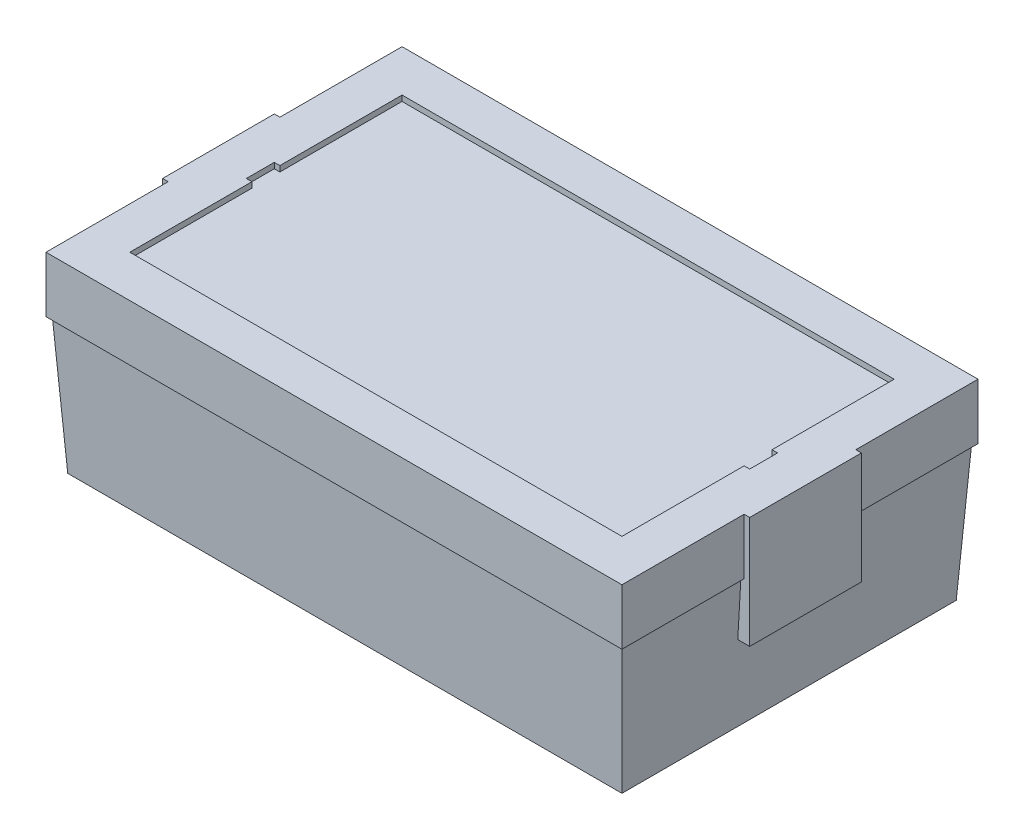
ISO-10303-21;
HEADER;
FILE_DESCRIPTION(('STEP AP214'),'2;1');
FILE_NAME('part.step','',(''),(''),'','','');
FILE_SCHEMA(('AUTOMOTIVE_DESIGN { 1 0 10303 214 1 1 1 1 }'));
ENDSEC;
DATA;
#1=APPLICATION_CONTEXT('core data for automotive mechanical design processes');
#2=APPLICATION_PROTOCOL_DEFINITION('international standard','automotive_design',2000,#1);
#3=PRODUCT_CONTEXT('',#1,'mechanical');
#4=PRODUCT('Part','Part','',(#3));
#5=PRODUCT_RELATED_PRODUCT_CATEGORY('part','',(#4));
#6=PRODUCT_DEFINITION_FORMATION('','',#4);
#7=PRODUCT_DEFINITION_CONTEXT('part definition',#1,'design');
#8=PRODUCT_DEFINITION('design','',#6,#7);
#9=PRODUCT_DEFINITION_SHAPE('','',#8);
#10=(LENGTH_UNIT() NAMED_UNIT(*) SI_UNIT(.MILLI.,.METRE.));
#11=(NAMED_UNIT(*) PLANE_ANGLE_UNIT() SI_UNIT($,.RADIAN.));
#12=(NAMED_UNIT(*) SI_UNIT($,.STERADIAN.) SOLID_ANGLE_UNIT());
#13=UNCERTAINTY_MEASURE_WITH_UNIT(LENGTH_MEASURE(1.E-05),#10,'distance_accuracy_value','');
#14=(GEOMETRIC_REPRESENTATION_CONTEXT(3) GLOBAL_UNCERTAINTY_ASSIGNED_CONTEXT((#13)) GLOBAL_UNIT_ASSIGNED_CONTEXT((#10,
#11,#12)) REPRESENTATION_CONTEXT('',''));
#15=CARTESIAN_POINT('',(0.,0.,0.));
#16=DIRECTION('',(0.,0.,1.));
#17=DIRECTION('',(1.,0.,0.));
#18=AXIS2_PLACEMENT_3D('',#15,#16,#17);
#19=CARTESIAN_POINT('',(0.,14.29,0.));
#20=DIRECTION('',(0.,1.,0.));
#21=DIRECTION('',(0.,0.,1.));
#22=AXIS2_PLACEMENT_3D('',#19,#20,#21);
#23=PLANE('',#22);
#24=DIRECTION('',(0.,0.,1.));
#25=VECTOR('',#24,1.);
#26=CARTESIAN_POINT('',(-101.978572312899,14.29,59.85));
#27=LINE('',#26,#25);
#28=CARTESIAN_POINT('',(-101.978572312899,14.29,-20.));
#29=VERTEX_POINT('',#28);
#30=CARTESIAN_POINT('',(-101.978572312899,14.29,-62.6085723128994));
#31=VERTEX_POINT('',#30);
#32=EDGE_CURVE('E454',#29,#31,#27,.F.);
#33=ORIENTED_EDGE('',*,*,#32,.F.);
#34=DIRECTION('',(-1.,0.,0.));
#35=VECTOR('',#34,1.);
#36=CARTESIAN_POINT('',(0.,14.29,-20.));
#37=LINE('',#36,#35);
#38=CARTESIAN_POINT('',(-103.114254615452,14.29,-20.));
#39=VERTEX_POINT('',#38);
#40=EDGE_CURVE('E385',#29,#39,#37,.T.);
#41=ORIENTED_EDGE('',*,*,#40,.T.);
#42=DIRECTION('',(0.,0.,1.));
#43=VECTOR('',#42,1.);
#44=CARTESIAN_POINT('',(-103.114254615452,14.29,-63.7442546154517));
#45=LINE('',#44,#43);
#46=CARTESIAN_POINT('',(-103.114254615452,14.29,-63.7442546154517));
#47=VERTEX_POINT('',#46);
#48=EDGE_CURVE('E433',#47,#39,#45,.T.);
#49=ORIENTED_EDGE('',*,*,#48,.F.);
#50=DIRECTION('',(-1.,0.,0.));
#51=VECTOR('',#50,1.);
#52=CARTESIAN_POINT('',(103.114254615452,14.29,-63.7442546154517));
#53=LINE('',#52,#51);
#54=CARTESIAN_POINT('',(103.114254615452,14.29,-63.7442546154517));
#55=VERTEX_POINT('',#54);
#56=EDGE_CURVE('E429',#55,#47,#53,.T.);
#57=ORIENTED_EDGE('',*,*,#56,.F.);
#58=DIRECTION('',(0.,0.,-1.));
#59=VECTOR('',#58,1.);
#60=CARTESIAN_POINT('',(103.114254615452,14.29,63.7442546154516));
#61=LINE('',#60,#59);
#62=CARTESIAN_POINT('',(103.114254615452,14.29,-20.));
#63=VERTEX_POINT('',#62);
#64=EDGE_CURVE('E425',#63,#55,#61,.T.);
#65=ORIENTED_EDGE('',*,*,#64,.F.);
#66=DIRECTION('',(1.,0.,0.));
#67=VECTOR('',#66,1.);
#68=CARTESIAN_POINT('',(0.,14.29,-20.));
#69=LINE('',#68,#67);
#70=CARTESIAN_POINT('',(101.978572312899,14.29,-20.));
#71=VERTEX_POINT('',#70);
#72=EDGE_CURVE('E418',#71,#63,#69,.T.);
#73=ORIENTED_EDGE('',*,*,#72,.F.);
#74=DIRECTION('',(0.,0.,-1.));
#75=VECTOR('',#74,1.);
#76=CARTESIAN_POINT('',(101.978572312899,14.29,-59.85));
#77=LINE('',#76,#75);
#78=CARTESIAN_POINT('',(101.978572312899,14.29,-62.6085723128994));
#79=VERTEX_POINT('',#78);
#80=EDGE_CURVE('E494',#79,#71,#77,.F.);
#81=ORIENTED_EDGE('',*,*,#80,.F.);
#82=DIRECTION('',(-1.,0.,0.));
#83=VECTOR('',#82,1.);
#84=CARTESIAN_POINT('',(-99.22,14.29,-62.6085723128994));
#85=LINE('',#84,#83);
#86=EDGE_CURVE('E458',#31,#79,#85,.F.);
#87=ORIENTED_EDGE('',*,*,#86,.F.);
#88=EDGE_LOOP('',(#33,#41,#49,#57,#65,#73,#81,#87));
#89=FACE_BOUND('',#88,.T.);
#90=ADVANCED_FACE('F41',(#89),#23,.F.);
#91=CARTESIAN_POINT('',(-103.114254615452,14.29,-63.7442546154517));
#92=DIRECTION('',(-1.,0.,0.));
#93=DIRECTION('',(0.,0.,1.));
#94=AXIS2_PLACEMENT_3D('',#91,#92,#93);
#95=PLANE('',#94);
#96=DIRECTION('',(0.,-1.,0.));
#97=VECTOR('',#96,1.);
#98=CARTESIAN_POINT('',(-103.114254615452,14.29,-20.));
#99=LINE('',#98,#97);
#100=CARTESIAN_POINT('',(-103.114254615452,34.29,-20.));
#101=VERTEX_POINT('',#100);
#102=EDGE_CURVE('E382',#101,#39,#99,.T.);
#103=ORIENTED_EDGE('',*,*,#102,.F.);
#104=DIRECTION('',(0.,0.,1.));
#105=VECTOR('',#104,1.);
#106=CARTESIAN_POINT('',(-103.114254615452,34.29,0.));
#107=LINE('',#106,#105);
#108=CARTESIAN_POINT('',(-103.114254615452,34.29,-63.7442546154517));
#109=VERTEX_POINT('',#108);
#110=EDGE_CURVE('E487',#101,#109,#107,.F.);
#111=ORIENTED_EDGE('',*,*,#110,.T.);
#112=DIRECTION('',(0.,1.,0.));
#113=VECTOR('',#112,1.);
#114=CARTESIAN_POINT('',(-103.114254615452,14.29,-63.7442546154517));
#115=LINE('',#114,#113);
#116=EDGE_CURVE('E447',#47,#109,#115,.T.);
#117=ORIENTED_EDGE('',*,*,#116,.F.);
#118=ORIENTED_EDGE('',*,*,#48,.T.);
#119=EDGE_LOOP('',(#103,#111,#117,#118));
#120=FACE_BOUND('',#119,.T.);
#121=ADVANCED_FACE('F550',(#120),#95,.T.);
#122=CARTESIAN_POINT('',(99.22,-34.29,-59.85));
#123=DIRECTION('',(-0.998391670557349,0.0566927875633776,0.));
#124=DIRECTION('',(-0.0566927875633777,-0.998391670557349,0.));
#125=AXIS2_PLACEMENT_3D('',#122,#123,#124);
#126=PLANE('',#125);
#127=ORIENTED_EDGE('',*,*,#80,.T.);
#128=DIRECTION('',(0.0566927875633777,0.998391670557349,0.));
#129=VECTOR('',#128,1.);
#130=CARTESIAN_POINT('',(99.22,-34.29,-20.));
#131=LINE('',#130,#129);
#132=CARTESIAN_POINT('',(100.842890010347,-5.71000000000001,-20.));
#133=VERTEX_POINT('',#132);
#134=EDGE_CURVE('E423',#71,#133,#131,.F.);
#135=ORIENTED_EDGE('',*,*,#134,.T.);
#136=DIRECTION('',(0.,0.,-1.));
#137=VECTOR('',#136,1.);
#138=CARTESIAN_POINT('',(100.842890010347,-5.71000000000001,-59.85));
#139=LINE('',#138,#137);
#140=CARTESIAN_POINT('',(100.842890010347,-5.71000000000001,20.));
#141=VERTEX_POINT('',#140);
#142=EDGE_CURVE('E49',#133,#141,#139,.F.);
#143=ORIENTED_EDGE('',*,*,#142,.T.);
#144=DIRECTION('',(-0.0566927875633777,-0.998391670557349,0.));
#145=VECTOR('',#144,1.);
#146=CARTESIAN_POINT('',(99.22,-34.29,20.));
#147=LINE('',#146,#145);
#148=CARTESIAN_POINT('',(101.978572312899,14.29,20.));
#149=VERTEX_POINT('',#148);
#150=EDGE_CURVE('E415',#141,#149,#147,.F.);
#151=ORIENTED_EDGE('',*,*,#150,.T.);
#152=CARTESIAN_POINT('',(101.978572312899,14.29,62.6085723128993));
#153=VERTEX_POINT('',#152);
#154=EDGE_CURVE('E493',#149,#153,#77,.F.);
#155=ORIENTED_EDGE('',*,*,#154,.T.);
#156=DIRECTION('',(-0.0566018992408724,-0.996791076407013,-0.0566018992408724));
#157=VECTOR('',#156,1.);
#158=CARTESIAN_POINT('',(98.8365081327785,-41.0435060880976,59.4665081327784));
#159=LINE('',#158,#157);
#160=CARTESIAN_POINT('',(99.22,-34.29,59.85));
#161=VERTEX_POINT('',#160);
#162=EDGE_CURVE('E475',#153,#161,#159,.T.);
#163=ORIENTED_EDGE('',*,*,#162,.T.);
#164=DIRECTION('',(0.,0.,1.));
#165=VECTOR('',#164,1.);
#166=CARTESIAN_POINT('',(99.22,-34.29,-59.85));
#167=LINE('',#166,#165);
#168=CARTESIAN_POINT('',(99.22,-34.29,-59.85));
#169=VERTEX_POINT('',#168);
#170=EDGE_CURVE('E464',#169,#161,#167,.T.);
#171=ORIENTED_EDGE('',*,*,#170,.F.);
#172=DIRECTION('',(-0.0566018992408724,-0.996791076407013,0.0566018992408724));
#173=VECTOR('',#172,1.);
#174=CARTESIAN_POINT('',(98.5842428894616,-45.4860379960074,-59.2142428894616));
#175=LINE('',#174,#173);
#176=EDGE_CURVE('E473',#79,#169,#175,.T.);
#177=ORIENTED_EDGE('',*,*,#176,.F.);
#178=EDGE_LOOP('',(#127,#135,#143,#151,#155,#163,#171,#177));
#179=FACE_BOUND('',#178,.T.);
#180=ADVANCED_FACE('F499',(#179),#126,.F.);
#181=CARTESIAN_POINT('',(103.114254615452,14.29,63.7442546154516));
#182=DIRECTION('',(1.,0.,0.));
#183=DIRECTION('',(0.,0.,-1.));
#184=AXIS2_PLACEMENT_3D('',#181,#182,#183);
#185=PLANE('',#184);
#186=DIRECTION('',(0.,0.,-1.));
#187=VECTOR('',#186,1.);
#188=CARTESIAN_POINT('',(103.114254615452,34.29,0.));
#189=LINE('',#188,#187);
#190=CARTESIAN_POINT('',(103.114254615452,34.29,-63.7442546154517));
#191=VERTEX_POINT('',#190);
#192=CARTESIAN_POINT('',(103.114254615452,34.29,-20.));
#193=VERTEX_POINT('',#192);
#194=EDGE_CURVE('E482',#191,#193,#189,.F.);
#195=ORIENTED_EDGE('',*,*,#194,.T.);
#196=DIRECTION('',(0.,-1.,0.));
#197=VECTOR('',#196,1.);
#198=CARTESIAN_POINT('',(103.114254615452,14.29,-20.));
#199=LINE('',#198,#197);
#200=EDGE_CURVE('E421',#193,#63,#199,.T.);
#201=ORIENTED_EDGE('',*,*,#200,.T.);
#202=ORIENTED_EDGE('',*,*,#64,.T.);
#203=DIRECTION('',(0.,1.,0.));
#204=VECTOR('',#203,1.);
#205=CARTESIAN_POINT('',(103.114254615452,14.29,-63.7442546154517));
#206=LINE('',#205,#204);
#207=EDGE_CURVE('E439',#55,#191,#206,.T.);
#208=ORIENTED_EDGE('',*,*,#207,.T.);
#209=EDGE_LOOP('',(#195,#201,#202,#208));
#210=FACE_BOUND('',#209,.T.);
#211=ADVANCED_FACE('F560',(#210),#185,.T.);
#212=CARTESIAN_POINT('',(103.114254615452,14.29,63.7442546154516));
#213=VERTEX_POINT('',#212);
#214=CARTESIAN_POINT('',(103.114254615452,14.29,20.));
#215=VERTEX_POINT('',#214);
#216=EDGE_CURVE('E426',#213,#215,#61,.T.);
#217=ORIENTED_EDGE('',*,*,#216,.T.);
#218=DIRECTION('',(0.,1.,0.));
#219=VECTOR('',#218,1.);
#220=CARTESIAN_POINT('',(103.114254615452,14.29,20.));
#221=LINE('',#220,#219);
#222=CARTESIAN_POINT('',(103.114254615452,34.29,20.));
#223=VERTEX_POINT('',#222);
#224=EDGE_CURVE('E413',#215,#223,#221,.T.);
#225=ORIENTED_EDGE('',*,*,#224,.T.);
#226=CARTESIAN_POINT('',(103.114254615452,34.29,63.7442546154516));
#227=VERTEX_POINT('',#226);
#228=EDGE_CURVE('E478',#223,#227,#189,.F.);
#229=ORIENTED_EDGE('',*,*,#228,.T.);
#230=DIRECTION('',(0.,1.,0.));
#231=VECTOR('',#230,1.);
#232=CARTESIAN_POINT('',(103.114254615452,14.29,63.7442546154516));
#233=LINE('',#232,#231);
#234=EDGE_CURVE('E440',#213,#227,#233,.T.);
#235=ORIENTED_EDGE('',*,*,#234,.F.);
#236=EDGE_LOOP('',(#217,#225,#229,#235));
#237=FACE_BOUND('',#236,.T.);
#238=ADVANCED_FACE('F520',(#237),#185,.T.);
#239=CARTESIAN_POINT('',(-103.114254615452,14.29,20.));
#240=VERTEX_POINT('',#239);
#241=CARTESIAN_POINT('',(-103.114254615452,14.29,63.7442546154516));
#242=VERTEX_POINT('',#241);
#243=EDGE_CURVE('E432',#240,#242,#45,.T.);
#244=ORIENTED_EDGE('',*,*,#243,.F.);
#245=DIRECTION('',(1.,0.,0.));
#246=VECTOR('',#245,1.);
#247=CARTESIAN_POINT('',(0.,14.29,20.));
#248=LINE('',#247,#246);
#249=CARTESIAN_POINT('',(-101.978572312899,14.29,20.));
#250=VERTEX_POINT('',#249);
#251=EDGE_CURVE('E377',#240,#250,#248,.T.);
#252=ORIENTED_EDGE('',*,*,#251,.T.);
#253=CARTESIAN_POINT('',(-101.978572312899,14.29,62.6085723128994));
#254=VERTEX_POINT('',#253);
#255=EDGE_CURVE('E455',#254,#250,#27,.F.);
#256=ORIENTED_EDGE('',*,*,#255,.F.);
#257=DIRECTION('',(1.,0.,0.));
#258=VECTOR('',#257,1.);
#259=CARTESIAN_POINT('',(99.22,14.29,62.6085723128994));
#260=LINE('',#259,#258);
#261=EDGE_CURVE('E443',#153,#254,#260,.F.);
#262=ORIENTED_EDGE('',*,*,#261,.F.);
#263=ORIENTED_EDGE('',*,*,#154,.F.);
#264=DIRECTION('',(-1.,0.,0.));
#265=VECTOR('',#264,1.);
#266=CARTESIAN_POINT('',(0.,14.29,20.));
#267=LINE('',#266,#265);
#268=EDGE_CURVE('E410',#215,#149,#267,.T.);
#269=ORIENTED_EDGE('',*,*,#268,.F.);
#270=ORIENTED_EDGE('',*,*,#216,.F.);
#271=DIRECTION('',(1.,0.,0.));
#272=VECTOR('',#271,1.);
#273=CARTESIAN_POINT('',(-103.114254615452,14.29,63.7442546154516));
#274=LINE('',#273,#272);
#275=EDGE_CURVE('E436',#242,#213,#274,.T.);
#276=ORIENTED_EDGE('',*,*,#275,.F.);
#277=EDGE_LOOP('',(#244,#252,#256,#262,#263,#269,#270,#276));
#278=FACE_BOUND('',#277,.T.);
#279=ADVANCED_FACE('F525',(#278),#23,.F.);
#280=CARTESIAN_POINT('',(-99.22,-34.29,-59.85));
#281=DIRECTION('',(0.,0.0566927875633776,0.998391670557349));
#282=DIRECTION('',(0.,-0.998391670557349,0.0566927875633777));
#283=AXIS2_PLACEMENT_3D('',#280,#281,#282);
#284=PLANE('',#283);
#285=DIRECTION('',(0.0566018992408724,-0.996791076407013,0.0566018992408724));
#286=VECTOR('',#285,1.);
#287=CARTESIAN_POINT('',(-98.8365081327784,-41.0435060880976,-59.4665081327784));
#288=LINE('',#287,#286);
#289=CARTESIAN_POINT('',(-99.22,-34.29,-59.85));
#290=VERTEX_POINT('',#289);
#291=EDGE_CURVE('E476',#31,#290,#288,.T.);
#292=ORIENTED_EDGE('',*,*,#291,.F.);
#293=ORIENTED_EDGE('',*,*,#86,.T.);
#294=ORIENTED_EDGE('',*,*,#176,.T.);
#295=DIRECTION('',(1.,0.,0.));
#296=VECTOR('',#295,1.);
#297=CARTESIAN_POINT('',(-99.22,-34.29,-59.85));
#298=LINE('',#297,#296);
#299=EDGE_CURVE('E461',#290,#169,#298,.T.);
#300=ORIENTED_EDGE('',*,*,#299,.F.);
#301=EDGE_LOOP('',(#292,#293,#294,#300));
#302=FACE_BOUND('',#301,.T.);
#303=ADVANCED_FACE('F580',(#302),#284,.F.);
#304=CARTESIAN_POINT('',(-99.22,-34.29,59.85));
#305=DIRECTION('',(0.998391670557349,0.0566927875633776,0.));
#306=DIRECTION('',(-0.0566927875633777,0.998391670557349,0.));
#307=AXIS2_PLACEMENT_3D('',#304,#305,#306);
#308=PLANE('',#307);
#309=DIRECTION('',(-0.0566927875633777,0.998391670557349,0.));
#310=VECTOR('',#309,1.);
#311=CARTESIAN_POINT('',(-99.22,-34.29,-20.));
#312=LINE('',#311,#310);
#313=CARTESIAN_POINT('',(-100.842890010347,-5.71000000000001,-20.));
#314=VERTEX_POINT('',#313);
#315=EDGE_CURVE('E387',#29,#314,#312,.F.);
#316=ORIENTED_EDGE('',*,*,#315,.F.);
#317=ORIENTED_EDGE('',*,*,#32,.T.);
#318=ORIENTED_EDGE('',*,*,#291,.T.);
#319=DIRECTION('',(0.,0.,-1.));
#320=VECTOR('',#319,1.);
#321=CARTESIAN_POINT('',(-99.22,-34.29,59.85));
#322=LINE('',#321,#320);
#323=CARTESIAN_POINT('',(-99.22,-34.29,59.85));
#324=VERTEX_POINT('',#323);
#325=EDGE_CURVE('E470',#324,#290,#322,.T.);
#326=ORIENTED_EDGE('',*,*,#325,.F.);
#327=DIRECTION('',(0.0566018992408724,-0.996791076407013,-0.0566018992408724));
#328=VECTOR('',#327,1.);
#329=CARTESIAN_POINT('',(-98.5842428894616,-45.4860379960074,59.2142428894616));
#330=LINE('',#329,#328);
#331=EDGE_CURVE('E479',#254,#324,#330,.T.);
#332=ORIENTED_EDGE('',*,*,#331,.F.);
#333=ORIENTED_EDGE('',*,*,#255,.T.);
#334=DIRECTION('',(0.0566927875633777,-0.998391670557349,0.));
#335=VECTOR('',#334,1.);
#336=CARTESIAN_POINT('',(-99.22,-34.29,20.));
#337=LINE('',#336,#335);
#338=CARTESIAN_POINT('',(-100.842890010347,-5.71000000000002,20.));
#339=VERTEX_POINT('',#338);
#340=EDGE_CURVE('E379',#339,#250,#337,.F.);
#341=ORIENTED_EDGE('',*,*,#340,.F.);
#342=DIRECTION('',(0.,0.,-1.));
#343=VECTOR('',#342,1.);
#344=CARTESIAN_POINT('',(-100.842890010347,-5.71000000000001,59.85));
#345=LINE('',#344,#343);
#346=EDGE_CURVE('E11',#314,#339,#345,.F.);
#347=ORIENTED_EDGE('',*,*,#346,.F.);
#348=EDGE_LOOP('',(#316,#317,#318,#326,#332,#333,#341,#347));
#349=FACE_BOUND('',#348,.T.);
#350=ADVANCED_FACE('F534',(#349),#308,.F.);
#351=CARTESIAN_POINT('',(99.22,-34.29,59.85));
#352=DIRECTION('',(0.,0.0566927875633776,-0.998391670557349));
#353=DIRECTION('',(0.,0.998391670557349,0.0566927875633777));
#354=AXIS2_PLACEMENT_3D('',#351,#352,#353);
#355=PLANE('',#354);
#356=ORIENTED_EDGE('',*,*,#162,.F.);
#357=ORIENTED_EDGE('',*,*,#261,.T.);
#358=ORIENTED_EDGE('',*,*,#331,.T.);
#359=DIRECTION('',(-1.,0.,0.));
#360=VECTOR('',#359,1.);
#361=CARTESIAN_POINT('',(99.22,-34.29,59.85));
#362=LINE('',#361,#360);
#363=EDGE_CURVE('E467',#161,#324,#362,.T.);
#364=ORIENTED_EDGE('',*,*,#363,.F.);
#365=EDGE_LOOP('',(#356,#357,#358,#364));
#366=FACE_BOUND('',#365,.T.);
#367=ADVANCED_FACE('F595',(#366),#355,.F.);
#368=CARTESIAN_POINT('',(0.,-34.29,0.));
#369=DIRECTION('',(0.,-1.,0.));
#370=DIRECTION('',(0.,0.,-1.));
#371=AXIS2_PLACEMENT_3D('',#368,#369,#370);
#372=PLANE('',#371);
#373=ORIENTED_EDGE('',*,*,#325,.T.);
#374=ORIENTED_EDGE('',*,*,#299,.T.);
#375=ORIENTED_EDGE('',*,*,#170,.T.);
#376=ORIENTED_EDGE('',*,*,#363,.T.);
#377=EDGE_LOOP('',(#373,#374,#375,#376));
#378=FACE_BOUND('',#377,.T.);
#379=ADVANCED_FACE('F43',(#378),#372,.T.);
#380=CARTESIAN_POINT('',(-103.114254615452,14.29,63.7442546154516));
#381=DIRECTION('',(0.,0.,1.));
#382=DIRECTION('',(1.,0.,0.));
#383=AXIS2_PLACEMENT_3D('',#380,#381,#382);
#384=PLANE('',#383);
#385=DIRECTION('',(1.,0.,0.));
#386=VECTOR('',#385,1.);
#387=CARTESIAN_POINT('',(0.,34.29,63.7442546154516));
#388=LINE('',#387,#386);
#389=CARTESIAN_POINT('',(-103.114254615452,34.29,63.7442546154516));
#390=VERTEX_POINT('',#389);
#391=EDGE_CURVE('E484',#227,#390,#388,.F.);
#392=ORIENTED_EDGE('',*,*,#391,.T.);
#393=DIRECTION('',(0.,1.,0.));
#394=VECTOR('',#393,1.);
#395=CARTESIAN_POINT('',(-103.114254615452,14.29,63.7442546154516));
#396=LINE('',#395,#394);
#397=EDGE_CURVE('E444',#242,#390,#396,.T.);
#398=ORIENTED_EDGE('',*,*,#397,.F.);
#399=ORIENTED_EDGE('',*,*,#275,.T.);
#400=ORIENTED_EDGE('',*,*,#234,.T.);
#401=EDGE_LOOP('',(#392,#398,#399,#400));
#402=FACE_BOUND('',#401,.T.);
#403=ADVANCED_FACE('F528',(#402),#384,.T.);
#404=DIRECTION('',(0.,1.,0.));
#405=VECTOR('',#404,1.);
#406=CARTESIAN_POINT('',(-103.114254615452,14.29,20.));
#407=LINE('',#406,#405);
#408=CARTESIAN_POINT('',(-103.114254615452,34.29,20.));
#409=VERTEX_POINT('',#408);
#410=EDGE_CURVE('E374',#240,#409,#407,.T.);
#411=ORIENTED_EDGE('',*,*,#410,.F.);
#412=ORIENTED_EDGE('',*,*,#243,.T.);
#413=ORIENTED_EDGE('',*,*,#397,.T.);
#414=EDGE_CURVE('E488',#390,#409,#107,.F.);
#415=ORIENTED_EDGE('',*,*,#414,.T.);
#416=EDGE_LOOP('',(#411,#412,#413,#415));
#417=FACE_BOUND('',#416,.T.);
#418=ADVANCED_FACE('F530',(#417),#95,.T.);
#419=CARTESIAN_POINT('',(103.114254615452,14.29,-63.7442546154517));
#420=DIRECTION('',(0.,0.,-1.));
#421=DIRECTION('',(-1.,0.,0.));
#422=AXIS2_PLACEMENT_3D('',#419,#420,#421);
#423=PLANE('',#422);
#424=DIRECTION('',(-1.,0.,0.));
#425=VECTOR('',#424,1.);
#426=CARTESIAN_POINT('',(0.,34.29,-63.7442546154517));
#427=LINE('',#426,#425);
#428=EDGE_CURVE('E490',#109,#191,#427,.F.);
#429=ORIENTED_EDGE('',*,*,#428,.T.);
#430=ORIENTED_EDGE('',*,*,#207,.F.);
#431=ORIENTED_EDGE('',*,*,#56,.T.);
#432=ORIENTED_EDGE('',*,*,#116,.T.);
#433=EDGE_LOOP('',(#429,#430,#431,#432));
#434=FACE_BOUND('',#433,.T.);
#435=ADVANCED_FACE('F558',(#434),#423,.T.);
#436=CARTESIAN_POINT('',(0.,34.29,0.));
#437=DIRECTION('',(0.,-1.,0.));
#438=DIRECTION('',(0.,0.,-1.));
#439=AXIS2_PLACEMENT_3D('',#436,#437,#438);
#440=PLANE('',#439);
#441=DIRECTION('',(1.,0.,0.));
#442=VECTOR('',#441,1.);
#443=CARTESIAN_POINT('',(-90.1142546154517,34.29,4.99999999999998));
#444=LINE('',#443,#442);
#445=CARTESIAN_POINT('',(-90.1142546154517,34.29,4.99999999999998));
#446=VERTEX_POINT('',#445);
#447=CARTESIAN_POINT('',(-88.1142546154517,34.29,4.99999999999998));
#448=VERTEX_POINT('',#447);
#449=EDGE_CURVE('E301',#446,#448,#444,.T.);
#450=ORIENTED_EDGE('',*,*,#449,.F.);
#451=DIRECTION('',(0.,0.,1.));
#452=VECTOR('',#451,1.);
#453=CARTESIAN_POINT('',(-90.1142546154517,34.29,-5.00000000000002));
#454=LINE('',#453,#452);
#455=CARTESIAN_POINT('',(-90.1142546154517,34.29,-5.00000000000002));
#456=VERTEX_POINT('',#455);
#457=EDGE_CURVE('E56',#456,#446,#454,.T.);
#458=ORIENTED_EDGE('',*,*,#457,.F.);
#459=DIRECTION('',(-1.,0.,0.));
#460=VECTOR('',#459,1.);
#461=CARTESIAN_POINT('',(-88.1142546154517,34.29,-5.00000000000002));
#462=LINE('',#461,#460);
#463=CARTESIAN_POINT('',(-88.1142546154517,34.29,-5.00000000000002));
#464=VERTEX_POINT('',#463);
#465=EDGE_CURVE('E269',#464,#456,#462,.T.);
#466=ORIENTED_EDGE('',*,*,#465,.F.);
#467=DIRECTION('',(0.,0.,1.));
#468=VECTOR('',#467,1.);
#469=CARTESIAN_POINT('',(-88.1142546154517,34.29,-48.7442546154517));
#470=LINE('',#469,#468);
#471=CARTESIAN_POINT('',(-88.1142546154517,34.29,-48.7442546154517));
#472=VERTEX_POINT('',#471);
#473=EDGE_CURVE('E272',#472,#464,#470,.T.);
#474=ORIENTED_EDGE('',*,*,#473,.F.);
#475=DIRECTION('',(-1.,0.,0.));
#476=VECTOR('',#475,1.);
#477=CARTESIAN_POINT('',(88.1142546154517,34.29,-48.7442546154517));
#478=LINE('',#477,#476);
#479=CARTESIAN_POINT('',(88.1142546154517,34.29,-48.7442546154517));
#480=VERTEX_POINT('',#479);
#481=EDGE_CURVE('E324',#480,#472,#478,.T.);
#482=ORIENTED_EDGE('',*,*,#481,.F.);
#483=DIRECTION('',(0.,0.,-1.));
#484=VECTOR('',#483,1.);
#485=CARTESIAN_POINT('',(88.1142546154517,34.29,-5.00000000000002));
#486=LINE('',#485,#484);
#487=CARTESIAN_POINT('',(88.1142546154517,34.29,-5.00000000000002));
#488=VERTEX_POINT('',#487);
#489=EDGE_CURVE('E321',#488,#480,#486,.T.);
#490=ORIENTED_EDGE('',*,*,#489,.F.);
#491=DIRECTION('',(-1.,0.,0.));
#492=VECTOR('',#491,1.);
#493=CARTESIAN_POINT('',(90.1142546154517,34.29,-5.00000000000002));
#494=LINE('',#493,#492);
#495=CARTESIAN_POINT('',(90.1142546154517,34.29,-5.00000000000002));
#496=VERTEX_POINT('',#495);
#497=EDGE_CURVE('E318',#496,#488,#494,.T.);
#498=ORIENTED_EDGE('',*,*,#497,.F.);
#499=DIRECTION('',(0.,0.,-1.));
#500=VECTOR('',#499,1.);
#501=CARTESIAN_POINT('',(90.1142546154517,34.29,4.99999999999998));
#502=LINE('',#501,#500);
#503=CARTESIAN_POINT('',(90.1142546154517,34.29,4.99999999999998));
#504=VERTEX_POINT('',#503);
#505=EDGE_CURVE('E315',#504,#496,#502,.T.);
#506=ORIENTED_EDGE('',*,*,#505,.F.);
#507=DIRECTION('',(1.,0.,0.));
#508=VECTOR('',#507,1.);
#509=CARTESIAN_POINT('',(88.1142546154517,34.29,4.99999999999998));
#510=LINE('',#509,#508);
#511=CARTESIAN_POINT('',(88.1142546154517,34.29,4.99999999999998));
#512=VERTEX_POINT('',#511);
#513=EDGE_CURVE('E312',#512,#504,#510,.T.);
#514=ORIENTED_EDGE('',*,*,#513,.F.);
#515=DIRECTION('',(0.,0.,-1.));
#516=VECTOR('',#515,1.);
#517=CARTESIAN_POINT('',(88.1142546154517,34.29,48.7442546154516));
#518=LINE('',#517,#516);
#519=CARTESIAN_POINT('',(88.1142546154517,34.29,48.7442546154516));
#520=VERTEX_POINT('',#519);
#521=EDGE_CURVE('E309',#520,#512,#518,.T.);
#522=ORIENTED_EDGE('',*,*,#521,.F.);
#523=DIRECTION('',(1.,0.,0.));
#524=VECTOR('',#523,1.);
#525=CARTESIAN_POINT('',(-88.1142546154516,34.29,48.7442546154516));
#526=LINE('',#525,#524);
#527=CARTESIAN_POINT('',(-88.1142546154516,34.29,48.7442546154516));
#528=VERTEX_POINT('',#527);
#529=EDGE_CURVE('E306',#528,#520,#526,.T.);
#530=ORIENTED_EDGE('',*,*,#529,.F.);
#531=DIRECTION('',(0.,0.,1.));
#532=VECTOR('',#531,1.);
#533=CARTESIAN_POINT('',(-88.1142546154517,34.29,4.99999999999998));
#534=LINE('',#533,#532);
#535=EDGE_CURVE('E303',#448,#528,#534,.T.);
#536=ORIENTED_EDGE('',*,*,#535,.F.);
#537=EDGE_LOOP('',(#450,#458,#466,#474,#482,#490,#498,#506,#514,#522,#530,#536));
#538=FACE_BOUND('',#537,.T.);
#539=ORIENTED_EDGE('',*,*,#110,.F.);
#540=DIRECTION('',(1.,0.,0.));
#541=VECTOR('',#540,1.);
#542=CARTESIAN_POINT('',(-105.114254615452,34.29,-20.));
#543=LINE('',#542,#541);
#544=CARTESIAN_POINT('',(-105.114254615452,34.29,-20.));
#545=VERTEX_POINT('',#544);
#546=EDGE_CURVE('E362',#545,#101,#543,.T.);
#547=ORIENTED_EDGE('',*,*,#546,.F.);
#548=DIRECTION('',(0.,0.,1.));
#549=VECTOR('',#548,1.);
#550=CARTESIAN_POINT('',(-105.114254615452,34.29,20.));
#551=LINE('',#550,#549);
#552=CARTESIAN_POINT('',(-105.114254615452,34.29,20.));
#553=VERTEX_POINT('',#552);
#554=EDGE_CURVE('E359',#545,#553,#551,.T.);
#555=ORIENTED_EDGE('',*,*,#554,.T.);
#556=DIRECTION('',(1.,0.,0.));
#557=VECTOR('',#556,1.);
#558=CARTESIAN_POINT('',(-105.114254615452,34.29,20.));
#559=LINE('',#558,#557);
#560=EDGE_CURVE('E365',#553,#409,#559,.T.);
#561=ORIENTED_EDGE('',*,*,#560,.T.);
#562=ORIENTED_EDGE('',*,*,#414,.F.);
#563=ORIENTED_EDGE('',*,*,#391,.F.);
#564=ORIENTED_EDGE('',*,*,#228,.F.);
#565=DIRECTION('',(-1.,0.,0.));
#566=VECTOR('',#565,1.);
#567=CARTESIAN_POINT('',(105.114254615452,34.29,20.));
#568=LINE('',#567,#566);
#569=CARTESIAN_POINT('',(105.114254615452,34.29,20.));
#570=VERTEX_POINT('',#569);
#571=EDGE_CURVE('E404',#570,#223,#568,.T.);
#572=ORIENTED_EDGE('',*,*,#571,.F.);
#573=DIRECTION('',(0.,0.,1.));
#574=VECTOR('',#573,1.);
#575=CARTESIAN_POINT('',(105.114254615452,34.29,20.));
#576=LINE('',#575,#574);
#577=CARTESIAN_POINT('',(105.114254615452,34.29,-20.));
#578=VERTEX_POINT('',#577);
#579=EDGE_CURVE('E392',#578,#570,#576,.T.);
#580=ORIENTED_EDGE('',*,*,#579,.F.);
#581=DIRECTION('',(-1.,0.,0.));
#582=VECTOR('',#581,1.);
#583=CARTESIAN_POINT('',(105.114254615452,34.29,-20.));
#584=LINE('',#583,#582);
#585=EDGE_CURVE('E407',#578,#193,#584,.T.);
#586=ORIENTED_EDGE('',*,*,#585,.T.);
#587=ORIENTED_EDGE('',*,*,#194,.F.);
#588=ORIENTED_EDGE('',*,*,#428,.F.);
#589=EDGE_LOOP('',(#539,#547,#555,#561,#562,#563,#564,#572,#580,#586,#587,#588));
#590=FACE_BOUND('',#589,.T.);
#591=ADVANCED_FACE('F517',(#538,#590),#440,.F.);
#592=CARTESIAN_POINT('',(105.114254615452,-5.71000000000001,-20.));
#593=DIRECTION('',(0.,0.,1.));
#594=DIRECTION('',(1.,0.,0.));
#595=AXIS2_PLACEMENT_3D('',#592,#593,#594);
#596=PLANE('',#595);
#597=ORIENTED_EDGE('',*,*,#134,.F.);
#598=ORIENTED_EDGE('',*,*,#72,.T.);
#599=ORIENTED_EDGE('',*,*,#200,.F.);
#600=ORIENTED_EDGE('',*,*,#585,.F.);
#601=DIRECTION('',(0.,1.,0.));
#602=VECTOR('',#601,1.);
#603=CARTESIAN_POINT('',(105.114254615452,-5.71000000000001,-20.));
#604=LINE('',#603,#602);
#605=CARTESIAN_POINT('',(105.114254615452,-5.71000000000001,-20.));
#606=VERTEX_POINT('',#605);
#607=EDGE_CURVE('E389',#606,#578,#604,.T.);
#608=ORIENTED_EDGE('',*,*,#607,.F.);
#609=DIRECTION('',(-1.,0.,0.));
#610=VECTOR('',#609,1.);
#611=CARTESIAN_POINT('',(105.114254615452,-5.71000000000001,-20.));
#612=LINE('',#611,#610);
#613=EDGE_CURVE('E398',#606,#133,#612,.T.);
#614=ORIENTED_EDGE('',*,*,#613,.T.);
#615=EDGE_LOOP('',(#597,#598,#599,#600,#608,#614));
#616=FACE_BOUND('',#615,.T.);
#617=ADVANCED_FACE('F563',(#616),#596,.F.);
#618=CARTESIAN_POINT('',(105.114254615452,-5.71000000000001,20.));
#619=DIRECTION('',(0.,0.,-1.));
#620=DIRECTION('',(-1.,0.,0.));
#621=AXIS2_PLACEMENT_3D('',#618,#619,#620);
#622=PLANE('',#621);
#623=ORIENTED_EDGE('',*,*,#150,.F.);
#624=DIRECTION('',(-1.,0.,0.));
#625=VECTOR('',#624,1.);
#626=CARTESIAN_POINT('',(105.114254615452,-5.71000000000001,20.));
#627=LINE('',#626,#625);
#628=CARTESIAN_POINT('',(105.114254615452,-5.71000000000001,20.));
#629=VERTEX_POINT('',#628);
#630=EDGE_CURVE('E401',#629,#141,#627,.T.);
#631=ORIENTED_EDGE('',*,*,#630,.F.);
#632=DIRECTION('',(0.,-1.,0.));
#633=VECTOR('',#632,1.);
#634=CARTESIAN_POINT('',(105.114254615452,-5.71000000000001,20.));
#635=LINE('',#634,#633);
#636=EDGE_CURVE('E394',#570,#629,#635,.T.);
#637=ORIENTED_EDGE('',*,*,#636,.F.);
#638=ORIENTED_EDGE('',*,*,#571,.T.);
#639=ORIENTED_EDGE('',*,*,#224,.F.);
#640=ORIENTED_EDGE('',*,*,#268,.T.);
#641=EDGE_LOOP('',(#623,#631,#637,#638,#639,#640));
#642=FACE_BOUND('',#641,.T.);
#643=ADVANCED_FACE('F505',(#642),#622,.F.);
#644=CARTESIAN_POINT('',(105.114254615452,-5.71000000000001,20.));
#645=DIRECTION('',(0.,1.,0.));
#646=DIRECTION('',(0.,0.,1.));
#647=AXIS2_PLACEMENT_3D('',#644,#645,#646);
#648=PLANE('',#647);
#649=ORIENTED_EDGE('',*,*,#142,.F.);
#650=ORIENTED_EDGE('',*,*,#613,.F.);
#651=DIRECTION('',(0.,0.,-1.));
#652=VECTOR('',#651,1.);
#653=CARTESIAN_POINT('',(105.114254615452,-5.71000000000001,20.));
#654=LINE('',#653,#652);
#655=EDGE_CURVE('E396',#629,#606,#654,.T.);
#656=ORIENTED_EDGE('',*,*,#655,.F.);
#657=ORIENTED_EDGE('',*,*,#630,.T.);
#658=EDGE_LOOP('',(#649,#650,#656,#657));
#659=FACE_BOUND('',#658,.T.);
#660=ADVANCED_FACE('F509',(#659),#648,.F.);
#661=CARTESIAN_POINT('',(105.114254615452,0.,0.));
#662=DIRECTION('',(-1.,0.,0.));
#663=DIRECTION('',(0.,0.,1.));
#664=AXIS2_PLACEMENT_3D('',#661,#662,#663);
#665=PLANE('',#664);
#666=ORIENTED_EDGE('',*,*,#607,.T.);
#667=ORIENTED_EDGE('',*,*,#579,.T.);
#668=ORIENTED_EDGE('',*,*,#636,.T.);
#669=ORIENTED_EDGE('',*,*,#655,.T.);
#670=EDGE_LOOP('',(#666,#667,#668,#669));
#671=FACE_BOUND('',#670,.T.);
#672=ADVANCED_FACE('F512',(#671),#665,.F.);
#673=CARTESIAN_POINT('',(-105.114254615452,-5.71000000000001,-20.));
#674=DIRECTION('',(0.,0.,-1.));
#675=DIRECTION('',(-1.,0.,0.));
#676=AXIS2_PLACEMENT_3D('',#673,#674,#675);
#677=PLANE('',#676);
#678=ORIENTED_EDGE('',*,*,#40,.F.);
#679=ORIENTED_EDGE('',*,*,#315,.T.);
#680=DIRECTION('',(1.,0.,0.));
#681=VECTOR('',#680,1.);
#682=CARTESIAN_POINT('',(-105.114254615452,-5.71000000000001,-20.));
#683=LINE('',#682,#681);
#684=CARTESIAN_POINT('',(-105.114254615452,-5.71000000000001,-20.));
#685=VERTEX_POINT('',#684);
#686=EDGE_CURVE('E371',#685,#314,#683,.T.);
#687=ORIENTED_EDGE('',*,*,#686,.F.);
#688=DIRECTION('',(0.,1.,0.));
#689=VECTOR('',#688,1.);
#690=CARTESIAN_POINT('',(-105.114254615452,-5.71000000000001,-20.));
#691=LINE('',#690,#689);
#692=EDGE_CURVE('E331',#685,#545,#691,.T.);
#693=ORIENTED_EDGE('',*,*,#692,.T.);
#694=ORIENTED_EDGE('',*,*,#546,.T.);
#695=ORIENTED_EDGE('',*,*,#102,.T.);
#696=EDGE_LOOP('',(#678,#679,#687,#693,#694,#695));
#697=FACE_BOUND('',#696,.T.);
#698=ADVANCED_FACE('F542',(#697),#677,.T.);
#699=CARTESIAN_POINT('',(-105.114254615452,-5.71000000000001,20.));
#700=DIRECTION('',(0.,-1.,0.));
#701=DIRECTION('',(0.,0.,-1.));
#702=AXIS2_PLACEMENT_3D('',#699,#700,#701);
#703=PLANE('',#702);
#704=ORIENTED_EDGE('',*,*,#686,.T.);
#705=ORIENTED_EDGE('',*,*,#346,.T.);
#706=DIRECTION('',(1.,0.,0.));
#707=VECTOR('',#706,1.);
#708=CARTESIAN_POINT('',(-105.114254615452,-5.71000000000001,20.));
#709=LINE('',#708,#707);
#710=CARTESIAN_POINT('',(-105.114254615452,-5.71000000000001,20.));
#711=VERTEX_POINT('',#710);
#712=EDGE_CURVE('E368',#711,#339,#709,.T.);
#713=ORIENTED_EDGE('',*,*,#712,.F.);
#714=DIRECTION('',(0.,0.,-1.));
#715=VECTOR('',#714,1.);
#716=CARTESIAN_POINT('',(-105.114254615452,-5.71000000000001,20.));
#717=LINE('',#716,#715);
#718=EDGE_CURVE('E353',#711,#685,#717,.T.);
#719=ORIENTED_EDGE('',*,*,#718,.T.);
#720=EDGE_LOOP('',(#704,#705,#713,#719));
#721=FACE_BOUND('',#720,.T.);
#722=ADVANCED_FACE('F537',(#721),#703,.T.);
#723=CARTESIAN_POINT('',(-105.114254615452,-5.71000000000001,20.));
#724=DIRECTION('',(0.,0.,1.));
#725=DIRECTION('',(1.,0.,0.));
#726=AXIS2_PLACEMENT_3D('',#723,#724,#725);
#727=PLANE('',#726);
#728=ORIENTED_EDGE('',*,*,#712,.T.);
#729=ORIENTED_EDGE('',*,*,#340,.T.);
#730=ORIENTED_EDGE('',*,*,#251,.F.);
#731=ORIENTED_EDGE('',*,*,#410,.T.);
#732=ORIENTED_EDGE('',*,*,#560,.F.);
#733=DIRECTION('',(0.,-1.,0.));
#734=VECTOR('',#733,1.);
#735=CARTESIAN_POINT('',(-105.114254615452,-5.71000000000001,20.));
#736=LINE('',#735,#734);
#737=EDGE_CURVE('E356',#553,#711,#736,.T.);
#738=ORIENTED_EDGE('',*,*,#737,.T.);
#739=EDGE_LOOP('',(#728,#729,#730,#731,#732,#738));
#740=FACE_BOUND('',#739,.T.);
#741=ADVANCED_FACE('F533',(#740),#727,.T.);
#742=CARTESIAN_POINT('',(-105.114254615452,0.,0.));
#743=DIRECTION('',(1.,0.,0.));
#744=DIRECTION('',(0.,0.,1.));
#745=AXIS2_PLACEMENT_3D('',#742,#743,#744);
#746=PLANE('',#745);
#747=ORIENTED_EDGE('',*,*,#692,.F.);
#748=ORIENTED_EDGE('',*,*,#718,.F.);
#749=ORIENTED_EDGE('',*,*,#737,.F.);
#750=ORIENTED_EDGE('',*,*,#554,.F.);
#751=EDGE_LOOP('',(#747,#748,#749,#750));
#752=FACE_BOUND('',#751,.T.);
#753=ADVANCED_FACE('F545',(#752),#746,.F.);
#754=CARTESIAN_POINT('',(-90.1142546154517,32.29,-5.00000000000002));
#755=DIRECTION('',(-1.,0.,0.));
#756=DIRECTION('',(0.,0.,1.));
#757=AXIS2_PLACEMENT_3D('',#754,#755,#756);
#758=PLANE('',#757);
#759=ORIENTED_EDGE('',*,*,#457,.T.);
#760=DIRECTION('',(0.,1.,0.));
#761=VECTOR('',#760,1.);
#762=CARTESIAN_POINT('',(-90.1142546154517,32.29,4.99999999999998));
#763=LINE('',#762,#761);
#764=CARTESIAN_POINT('',(-90.1142546154517,32.29,4.99999999999998));
#765=VERTEX_POINT('',#764);
#766=EDGE_CURVE('E246',#765,#446,#763,.T.);
#767=ORIENTED_EDGE('',*,*,#766,.F.);
#768=DIRECTION('',(0.,0.,1.));
#769=VECTOR('',#768,1.);
#770=CARTESIAN_POINT('',(-90.1142546154517,32.29,-5.00000000000002));
#771=LINE('',#770,#769);
#772=CARTESIAN_POINT('',(-90.1142546154517,32.29,-5.00000000000002));
#773=VERTEX_POINT('',#772);
#774=EDGE_CURVE('E250',#773,#765,#771,.T.);
#775=ORIENTED_EDGE('',*,*,#774,.F.);
#776=DIRECTION('',(0.,1.,0.));
#777=VECTOR('',#776,1.);
#778=CARTESIAN_POINT('',(-90.1142546154517,32.29,-5.00000000000002));
#779=LINE('',#778,#777);
#780=EDGE_CURVE('E329',#773,#456,#779,.T.);
#781=ORIENTED_EDGE('',*,*,#780,.T.);
#782=EDGE_LOOP('',(#759,#767,#775,#781));
#783=FACE_BOUND('',#782,.T.);
#784=ADVANCED_FACE('F248',(#783),#758,.F.);
#785=CARTESIAN_POINT('',(-88.1142546154517,32.29,-5.00000000000002));
#786=DIRECTION('',(0.,0.,-1.));
#787=DIRECTION('',(-1.,0.,0.));
#788=AXIS2_PLACEMENT_3D('',#785,#786,#787);
#789=PLANE('',#788);
#790=ORIENTED_EDGE('',*,*,#465,.T.);
#791=ORIENTED_EDGE('',*,*,#780,.F.);
#792=DIRECTION('',(-1.,0.,0.));
#793=VECTOR('',#792,1.);
#794=CARTESIAN_POINT('',(-88.1142546154517,32.29,-5.00000000000002));
#795=LINE('',#794,#793);
#796=CARTESIAN_POINT('',(-88.1142546154517,32.29,-5.00000000000002));
#797=VERTEX_POINT('',#796);
#798=EDGE_CURVE('E256',#797,#773,#795,.T.);
#799=ORIENTED_EDGE('',*,*,#798,.F.);
#800=DIRECTION('',(0.,1.,0.));
#801=VECTOR('',#800,1.);
#802=CARTESIAN_POINT('',(-88.1142546154517,32.29,-5.00000000000002));
#803=LINE('',#802,#801);
#804=EDGE_CURVE('E332',#797,#464,#803,.T.);
#805=ORIENTED_EDGE('',*,*,#804,.T.);
#806=EDGE_LOOP('',(#790,#791,#799,#805));
#807=FACE_BOUND('',#806,.T.);
#808=ADVANCED_FACE('F739',(#807),#789,.F.);
#809=CARTESIAN_POINT('',(-88.1142546154517,32.29,-48.7442546154517));
#810=DIRECTION('',(-1.,0.,0.));
#811=DIRECTION('',(0.,0.,1.));
#812=AXIS2_PLACEMENT_3D('',#809,#810,#811);
#813=PLANE('',#812);
#814=ORIENTED_EDGE('',*,*,#473,.T.);
#815=ORIENTED_EDGE('',*,*,#804,.F.);
#816=DIRECTION('',(0.,0.,1.));
#817=VECTOR('',#816,1.);
#818=CARTESIAN_POINT('',(-88.1142546154517,32.29,-48.7442546154517));
#819=LINE('',#818,#817);
#820=CARTESIAN_POINT('',(-88.1142546154517,32.29,-48.7442546154517));
#821=VERTEX_POINT('',#820);
#822=EDGE_CURVE('E297',#821,#797,#819,.T.);
#823=ORIENTED_EDGE('',*,*,#822,.F.);
#824=DIRECTION('',(0.,1.,0.));
#825=VECTOR('',#824,1.);
#826=CARTESIAN_POINT('',(-88.1142546154517,32.29,-48.7442546154517));
#827=LINE('',#826,#825);
#828=EDGE_CURVE('E334',#821,#472,#827,.T.);
#829=ORIENTED_EDGE('',*,*,#828,.T.);
#830=EDGE_LOOP('',(#814,#815,#823,#829));
#831=FACE_BOUND('',#830,.T.);
#832=ADVANCED_FACE('F748',(#831),#813,.F.);
#833=CARTESIAN_POINT('',(88.1142546154517,32.29,-48.7442546154517));
#834=DIRECTION('',(0.,0.,-1.));
#835=DIRECTION('',(-1.,0.,0.));
#836=AXIS2_PLACEMENT_3D('',#833,#834,#835);
#837=PLANE('',#836);
#838=ORIENTED_EDGE('',*,*,#481,.T.);
#839=ORIENTED_EDGE('',*,*,#828,.F.);
#840=DIRECTION('',(-1.,0.,0.));
#841=VECTOR('',#840,1.);
#842=CARTESIAN_POINT('',(88.1142546154517,32.29,-48.7442546154517));
#843=LINE('',#842,#841);
#844=CARTESIAN_POINT('',(88.1142546154517,32.29,-48.7442546154517));
#845=VERTEX_POINT('',#844);
#846=EDGE_CURVE('E294',#845,#821,#843,.T.);
#847=ORIENTED_EDGE('',*,*,#846,.F.);
#848=DIRECTION('',(0.,1.,0.));
#849=VECTOR('',#848,1.);
#850=CARTESIAN_POINT('',(88.1142546154517,32.29,-48.7442546154517));
#851=LINE('',#850,#849);
#852=EDGE_CURVE('E336',#845,#480,#851,.T.);
#853=ORIENTED_EDGE('',*,*,#852,.T.);
#854=EDGE_LOOP('',(#838,#839,#847,#853));
#855=FACE_BOUND('',#854,.T.);
#856=ADVANCED_FACE('F758',(#855),#837,.F.);
#857=CARTESIAN_POINT('',(88.1142546154517,32.29,-5.00000000000002));
#858=DIRECTION('',(1.,0.,0.));
#859=DIRECTION('',(0.,0.,-1.));
#860=AXIS2_PLACEMENT_3D('',#857,#858,#859);
#861=PLANE('',#860);
#862=ORIENTED_EDGE('',*,*,#489,.T.);
#863=ORIENTED_EDGE('',*,*,#852,.F.);
#864=DIRECTION('',(0.,0.,-1.));
#865=VECTOR('',#864,1.);
#866=CARTESIAN_POINT('',(88.1142546154517,32.29,-5.00000000000002));
#867=LINE('',#866,#865);
#868=CARTESIAN_POINT('',(88.1142546154517,32.29,-5.00000000000002));
#869=VERTEX_POINT('',#868);
#870=EDGE_CURVE('E291',#869,#845,#867,.T.);
#871=ORIENTED_EDGE('',*,*,#870,.F.);
#872=DIRECTION('',(0.,1.,0.));
#873=VECTOR('',#872,1.);
#874=CARTESIAN_POINT('',(88.1142546154517,32.29,-5.00000000000002));
#875=LINE('',#874,#873);
#876=EDGE_CURVE('E338',#869,#488,#875,.T.);
#877=ORIENTED_EDGE('',*,*,#876,.T.);
#878=EDGE_LOOP('',(#862,#863,#871,#877));
#879=FACE_BOUND('',#878,.T.);
#880=ADVANCED_FACE('F768',(#879),#861,.F.);
#881=CARTESIAN_POINT('',(90.1142546154517,32.29,-5.00000000000002));
#882=DIRECTION('',(0.,0.,-1.));
#883=DIRECTION('',(-1.,0.,0.));
#884=AXIS2_PLACEMENT_3D('',#881,#882,#883);
#885=PLANE('',#884);
#886=ORIENTED_EDGE('',*,*,#497,.T.);
#887=ORIENTED_EDGE('',*,*,#876,.F.);
#888=DIRECTION('',(-1.,0.,0.));
#889=VECTOR('',#888,1.);
#890=CARTESIAN_POINT('',(90.1142546154517,32.29,-5.00000000000002));
#891=LINE('',#890,#889);
#892=CARTESIAN_POINT('',(90.1142546154517,32.29,-5.00000000000002));
#893=VERTEX_POINT('',#892);
#894=EDGE_CURVE('E288',#893,#869,#891,.T.);
#895=ORIENTED_EDGE('',*,*,#894,.F.);
#896=DIRECTION('',(0.,1.,0.));
#897=VECTOR('',#896,1.);
#898=CARTESIAN_POINT('',(90.1142546154517,32.29,-5.00000000000002));
#899=LINE('',#898,#897);
#900=EDGE_CURVE('E340',#893,#496,#899,.T.);
#901=ORIENTED_EDGE('',*,*,#900,.T.);
#902=EDGE_LOOP('',(#886,#887,#895,#901));
#903=FACE_BOUND('',#902,.T.);
#904=ADVANCED_FACE('F779',(#903),#885,.F.);
#905=CARTESIAN_POINT('',(90.1142546154517,32.29,4.99999999999998));
#906=DIRECTION('',(1.,0.,0.));
#907=DIRECTION('',(0.,0.,-1.));
#908=AXIS2_PLACEMENT_3D('',#905,#906,#907);
#909=PLANE('',#908);
#910=ORIENTED_EDGE('',*,*,#505,.T.);
#911=ORIENTED_EDGE('',*,*,#900,.F.);
#912=DIRECTION('',(0.,0.,-1.));
#913=VECTOR('',#912,1.);
#914=CARTESIAN_POINT('',(90.1142546154517,32.29,4.99999999999998));
#915=LINE('',#914,#913);
#916=CARTESIAN_POINT('',(90.1142546154517,32.29,4.99999999999998));
#917=VERTEX_POINT('',#916);
#918=EDGE_CURVE('E285',#917,#893,#915,.T.);
#919=ORIENTED_EDGE('',*,*,#918,.F.);
#920=DIRECTION('',(0.,1.,0.));
#921=VECTOR('',#920,1.);
#922=CARTESIAN_POINT('',(90.1142546154517,32.29,4.99999999999998));
#923=LINE('',#922,#921);
#924=EDGE_CURVE('E342',#917,#504,#923,.T.);
#925=ORIENTED_EDGE('',*,*,#924,.T.);
#926=EDGE_LOOP('',(#910,#911,#919,#925));
#927=FACE_BOUND('',#926,.T.);
#928=ADVANCED_FACE('F789',(#927),#909,.F.);
#929=CARTESIAN_POINT('',(88.1142546154517,32.29,4.99999999999998));
#930=DIRECTION('',(0.,0.,1.));
#931=DIRECTION('',(1.,0.,0.));
#932=AXIS2_PLACEMENT_3D('',#929,#930,#931);
#933=PLANE('',#932);
#934=ORIENTED_EDGE('',*,*,#513,.T.);
#935=ORIENTED_EDGE('',*,*,#924,.F.);
#936=DIRECTION('',(1.,0.,0.));
#937=VECTOR('',#936,1.);
#938=CARTESIAN_POINT('',(88.1142546154517,32.29,4.99999999999998));
#939=LINE('',#938,#937);
#940=CARTESIAN_POINT('',(88.1142546154517,32.29,4.99999999999998));
#941=VERTEX_POINT('',#940);
#942=EDGE_CURVE('E282',#941,#917,#939,.T.);
#943=ORIENTED_EDGE('',*,*,#942,.F.);
#944=DIRECTION('',(0.,1.,0.));
#945=VECTOR('',#944,1.);
#946=CARTESIAN_POINT('',(88.1142546154517,32.29,4.99999999999998));
#947=LINE('',#946,#945);
#948=EDGE_CURVE('E344',#941,#512,#947,.T.);
#949=ORIENTED_EDGE('',*,*,#948,.T.);
#950=EDGE_LOOP('',(#934,#935,#943,#949));
#951=FACE_BOUND('',#950,.T.);
#952=ADVANCED_FACE('F799',(#951),#933,.F.);
#953=CARTESIAN_POINT('',(88.1142546154517,32.29,48.7442546154516));
#954=DIRECTION('',(1.,0.,0.));
#955=DIRECTION('',(0.,0.,-1.));
#956=AXIS2_PLACEMENT_3D('',#953,#954,#955);
#957=PLANE('',#956);
#958=ORIENTED_EDGE('',*,*,#521,.T.);
#959=ORIENTED_EDGE('',*,*,#948,.F.);
#960=DIRECTION('',(0.,0.,-1.));
#961=VECTOR('',#960,1.);
#962=CARTESIAN_POINT('',(88.1142546154517,32.29,48.7442546154516));
#963=LINE('',#962,#961);
#964=CARTESIAN_POINT('',(88.1142546154517,32.29,48.7442546154516));
#965=VERTEX_POINT('',#964);
#966=EDGE_CURVE('E279',#965,#941,#963,.T.);
#967=ORIENTED_EDGE('',*,*,#966,.F.);
#968=DIRECTION('',(0.,1.,0.));
#969=VECTOR('',#968,1.);
#970=CARTESIAN_POINT('',(88.1142546154517,32.29,48.7442546154516));
#971=LINE('',#970,#969);
#972=EDGE_CURVE('E346',#965,#520,#971,.T.);
#973=ORIENTED_EDGE('',*,*,#972,.T.);
#974=EDGE_LOOP('',(#958,#959,#967,#973));
#975=FACE_BOUND('',#974,.T.);
#976=ADVANCED_FACE('F809',(#975),#957,.F.);
#977=CARTESIAN_POINT('',(-88.1142546154516,32.29,48.7442546154516));
#978=DIRECTION('',(0.,0.,1.));
#979=DIRECTION('',(1.,0.,0.));
#980=AXIS2_PLACEMENT_3D('',#977,#978,#979);
#981=PLANE('',#980);
#982=ORIENTED_EDGE('',*,*,#529,.T.);
#983=ORIENTED_EDGE('',*,*,#972,.F.);
#984=DIRECTION('',(1.,0.,0.));
#985=VECTOR('',#984,1.);
#986=CARTESIAN_POINT('',(-88.1142546154516,32.29,48.7442546154516));
#987=LINE('',#986,#985);
#988=CARTESIAN_POINT('',(-88.1142546154516,32.29,48.7442546154516));
#989=VERTEX_POINT('',#988);
#990=EDGE_CURVE('E276',#989,#965,#987,.T.);
#991=ORIENTED_EDGE('',*,*,#990,.F.);
#992=DIRECTION('',(0.,1.,0.));
#993=VECTOR('',#992,1.);
#994=CARTESIAN_POINT('',(-88.1142546154516,32.29,48.7442546154516));
#995=LINE('',#994,#993);
#996=EDGE_CURVE('E348',#989,#528,#995,.T.);
#997=ORIENTED_EDGE('',*,*,#996,.T.);
#998=EDGE_LOOP('',(#982,#983,#991,#997));
#999=FACE_BOUND('',#998,.T.);
#1000=ADVANCED_FACE('F819',(#999),#981,.F.);
#1001=CARTESIAN_POINT('',(-88.1142546154517,32.29,4.99999999999998));
#1002=DIRECTION('',(-1.,0.,0.));
#1003=DIRECTION('',(0.,0.,1.));
#1004=AXIS2_PLACEMENT_3D('',#1001,#1002,#1003);
#1005=PLANE('',#1004);
#1006=ORIENTED_EDGE('',*,*,#535,.T.);
#1007=ORIENTED_EDGE('',*,*,#996,.F.);
#1008=DIRECTION('',(0.,0.,1.));
#1009=VECTOR('',#1008,1.);
#1010=CARTESIAN_POINT('',(-88.1142546154517,32.29,4.99999999999998));
#1011=LINE('',#1010,#1009);
#1012=CARTESIAN_POINT('',(-88.1142546154517,32.29,4.99999999999998));
#1013=VERTEX_POINT('',#1012);
#1014=EDGE_CURVE('E264',#1013,#989,#1011,.T.);
#1015=ORIENTED_EDGE('',*,*,#1014,.F.);
#1016=DIRECTION('',(0.,1.,0.));
#1017=VECTOR('',#1016,1.);
#1018=CARTESIAN_POINT('',(-88.1142546154517,32.29,4.99999999999998));
#1019=LINE('',#1018,#1017);
#1020=EDGE_CURVE('E255',#1013,#448,#1019,.T.);
#1021=ORIENTED_EDGE('',*,*,#1020,.T.);
#1022=EDGE_LOOP('',(#1006,#1007,#1015,#1021));
#1023=FACE_BOUND('',#1022,.T.);
#1024=ADVANCED_FACE('F828',(#1023),#1005,.F.);
#1025=CARTESIAN_POINT('',(-90.1142546154517,32.29,4.99999999999998));
#1026=DIRECTION('',(0.,0.,1.));
#1027=DIRECTION('',(1.,0.,0.));
#1028=AXIS2_PLACEMENT_3D('',#1025,#1026,#1027);
#1029=PLANE('',#1028);
#1030=ORIENTED_EDGE('',*,*,#449,.T.);
#1031=ORIENTED_EDGE('',*,*,#1020,.F.);
#1032=DIRECTION('',(1.,0.,0.));
#1033=VECTOR('',#1032,1.);
#1034=CARTESIAN_POINT('',(-90.1142546154517,32.29,4.99999999999998));
#1035=LINE('',#1034,#1033);
#1036=EDGE_CURVE('E259',#765,#1013,#1035,.T.);
#1037=ORIENTED_EDGE('',*,*,#1036,.F.);
#1038=ORIENTED_EDGE('',*,*,#766,.T.);
#1039=EDGE_LOOP('',(#1030,#1031,#1037,#1038));
#1040=FACE_BOUND('',#1039,.T.);
#1041=ADVANCED_FACE('F260',(#1040),#1029,.F.);
#1042=CARTESIAN_POINT('',(0.,32.29,0.));
#1043=DIRECTION('',(0.,1.,0.));
#1044=DIRECTION('',(0.,0.,1.));
#1045=AXIS2_PLACEMENT_3D('',#1042,#1043,#1044);
#1046=PLANE('',#1045);
#1047=ORIENTED_EDGE('',*,*,#774,.T.);
#1048=ORIENTED_EDGE('',*,*,#1036,.T.);
#1049=ORIENTED_EDGE('',*,*,#1014,.T.);
#1050=ORIENTED_EDGE('',*,*,#990,.T.);
#1051=ORIENTED_EDGE('',*,*,#966,.T.);
#1052=ORIENTED_EDGE('',*,*,#942,.T.);
#1053=ORIENTED_EDGE('',*,*,#918,.T.);
#1054=ORIENTED_EDGE('',*,*,#894,.T.);
#1055=ORIENTED_EDGE('',*,*,#870,.T.);
#1056=ORIENTED_EDGE('',*,*,#846,.T.);
#1057=ORIENTED_EDGE('',*,*,#822,.T.);
#1058=ORIENTED_EDGE('',*,*,#798,.T.);
#1059=EDGE_LOOP('',(#1047,#1048,#1049,#1050,#1051,#1052,#1053,#1054,#1055,#1056,#1057,#1058));
#1060=FACE_BOUND('',#1059,.T.);
#1061=ADVANCED_FACE('F266',(#1060),#1046,.T.);
#1062=CLOSED_SHELL('',(#90,#121,#180,#211,#238,#279,#303,#350,#367,#379,#403,#418,#435,#591,
#617,#643,#660,#672,#698,#722,#741,#753,#784,#808,#832,#856,#880,#904,#928,#952,#976,#1000,
#1024,#1041,#1061));
#1063=MANIFOLD_SOLID_BREP('B2',#1062);
#1064=ADVANCED_BREP_SHAPE_REPRESENTATION('',(#18,#1063),#14);
#1065=SHAPE_DEFINITION_REPRESENTATION(#9,#1064);
ENDSEC;
END-ISO-10303-21;
